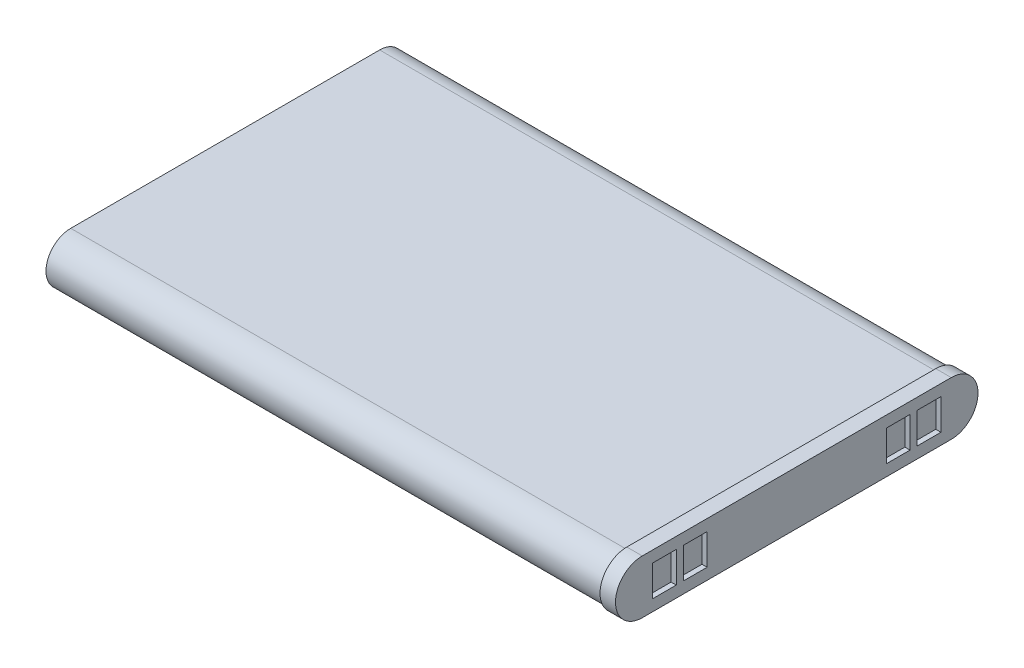
ISO-10303-21;
HEADER;
FILE_DESCRIPTION(('STEP AP214'),'2;1');
FILE_NAME('part.step','',(''),(''),'','','');
FILE_SCHEMA(('AUTOMOTIVE_DESIGN { 1 0 10303 214 1 1 1 1 }'));
ENDSEC;
DATA;
#1=APPLICATION_CONTEXT('core data for automotive mechanical design processes');
#2=APPLICATION_PROTOCOL_DEFINITION('international standard','automotive_design',2000,#1);
#3=PRODUCT_CONTEXT('',#1,'mechanical');
#4=PRODUCT('Part','Part','',(#3));
#5=PRODUCT_RELATED_PRODUCT_CATEGORY('part','',(#4));
#6=PRODUCT_DEFINITION_FORMATION('','',#4);
#7=PRODUCT_DEFINITION_CONTEXT('part definition',#1,'design');
#8=PRODUCT_DEFINITION('design','',#6,#7);
#9=PRODUCT_DEFINITION_SHAPE('','',#8);
#10=(LENGTH_UNIT() NAMED_UNIT(*) SI_UNIT(.MILLI.,.METRE.));
#11=(NAMED_UNIT(*) PLANE_ANGLE_UNIT() SI_UNIT($,.RADIAN.));
#12=(NAMED_UNIT(*) SI_UNIT($,.STERADIAN.) SOLID_ANGLE_UNIT());
#13=UNCERTAINTY_MEASURE_WITH_UNIT(LENGTH_MEASURE(1.E-05),#10,'distance_accuracy_value','');
#14=(GEOMETRIC_REPRESENTATION_CONTEXT(3) GLOBAL_UNCERTAINTY_ASSIGNED_CONTEXT((#13)) GLOBAL_UNIT_ASSIGNED_CONTEXT((#10,
#11,#12)) REPRESENTATION_CONTEXT('',''));
#15=CARTESIAN_POINT('',(0.,0.,0.));
#16=DIRECTION('',(0.,0.,1.));
#17=DIRECTION('',(1.,0.,0.));
#18=AXIS2_PLACEMENT_3D('',#15,#16,#17);
#19=CARTESIAN_POINT('',(54.,0.,15.));
#20=DIRECTION('',(-1.,0.,0.));
#21=DIRECTION('',(0.,0.,1.));
#22=AXIS2_PLACEMENT_3D('',#19,#20,#21);
#23=CYLINDRICAL_SURFACE('',#22,2.4);
#24=CARTESIAN_POINT('',(0.,0.,15.));
#25=DIRECTION('',(1.,0.,0.));
#26=DIRECTION('',(0.,0.,-1.));
#27=AXIS2_PLACEMENT_3D('',#24,#25,#26);
#28=CIRCLE('',#27,2.4);
#29=CARTESIAN_POINT('',(0.,2.4,15.));
#30=VERTEX_POINT('',#29);
#31=CARTESIAN_POINT('',(0.,-2.4,15.));
#32=VERTEX_POINT('',#31);
#33=EDGE_CURVE('E357',#30,#32,#28,.T.);
#34=ORIENTED_EDGE('',*,*,#33,.T.);
#35=DIRECTION('',(-1.,0.,0.));
#36=VECTOR('',#35,1.);
#37=CARTESIAN_POINT('',(54.,-2.4,15.));
#38=LINE('',#37,#36);
#39=CARTESIAN_POINT('',(54.,-2.4,15.));
#40=VERTEX_POINT('',#39);
#41=EDGE_CURVE('E11',#40,#32,#38,.T.);
#42=ORIENTED_EDGE('',*,*,#41,.F.);
#43=CARTESIAN_POINT('',(54.,0.,15.));
#44=DIRECTION('',(1.,0.,0.));
#45=DIRECTION('',(0.,0.,-1.));
#46=AXIS2_PLACEMENT_3D('',#43,#44,#45);
#47=CIRCLE('',#46,2.4);
#48=CARTESIAN_POINT('',(54.,2.4,15.));
#49=VERTEX_POINT('',#48);
#50=EDGE_CURVE('E358',#49,#40,#47,.T.);
#51=ORIENTED_EDGE('',*,*,#50,.F.);
#52=DIRECTION('',(-1.,0.,0.));
#53=VECTOR('',#52,1.);
#54=CARTESIAN_POINT('',(54.,2.4,15.));
#55=LINE('',#54,#53);
#56=EDGE_CURVE('E371',#49,#30,#55,.T.);
#57=ORIENTED_EDGE('',*,*,#56,.T.);
#58=EDGE_LOOP('',(#34,#42,#51,#57));
#59=FACE_BOUND('',#58,.T.);
#60=ADVANCED_FACE('F35',(#59),#23,.T.);
#61=CARTESIAN_POINT('',(54.,-2.4,15.));
#62=DIRECTION('',(0.,1.,0.));
#63=DIRECTION('',(0.,0.,1.));
#64=AXIS2_PLACEMENT_3D('',#61,#62,#63);
#65=PLANE('',#64);
#66=DIRECTION('',(0.,0.,-1.));
#67=VECTOR('',#66,1.);
#68=CARTESIAN_POINT('',(0.,-2.4,15.));
#69=LINE('',#68,#67);
#70=CARTESIAN_POINT('',(0.,-2.4,-15.));
#71=VERTEX_POINT('',#70);
#72=EDGE_CURVE('E374',#32,#71,#69,.T.);
#73=ORIENTED_EDGE('',*,*,#72,.T.);
#74=DIRECTION('',(-1.,0.,0.));
#75=VECTOR('',#74,1.);
#76=CARTESIAN_POINT('',(54.,-2.4,-15.));
#77=LINE('',#76,#75);
#78=CARTESIAN_POINT('',(54.,-2.4,-15.));
#79=VERTEX_POINT('',#78);
#80=EDGE_CURVE('E42',#79,#71,#77,.T.);
#81=ORIENTED_EDGE('',*,*,#80,.F.);
#82=DIRECTION('',(0.,0.,-1.));
#83=VECTOR('',#82,1.);
#84=CARTESIAN_POINT('',(54.,-2.4,15.));
#85=LINE('',#84,#83);
#86=EDGE_CURVE('E361',#40,#79,#85,.T.);
#87=ORIENTED_EDGE('',*,*,#86,.F.);
#88=ORIENTED_EDGE('',*,*,#41,.T.);
#89=EDGE_LOOP('',(#73,#81,#87,#88));
#90=FACE_BOUND('',#89,.T.);
#91=ADVANCED_FACE('F401',(#90),#65,.F.);
#92=CARTESIAN_POINT('',(54.,0.,-15.));
#93=DIRECTION('',(-1.,0.,0.));
#94=DIRECTION('',(0.,0.,1.));
#95=AXIS2_PLACEMENT_3D('',#92,#93,#94);
#96=CYLINDRICAL_SURFACE('',#95,2.4);
#97=CARTESIAN_POINT('',(0.,0.,-15.));
#98=DIRECTION('',(1.,0.,0.));
#99=DIRECTION('',(0.,0.,-1.));
#100=AXIS2_PLACEMENT_3D('',#97,#98,#99);
#101=CIRCLE('',#100,2.4);
#102=CARTESIAN_POINT('',(0.,2.40000000000001,-15.));
#103=VERTEX_POINT('',#102);
#104=EDGE_CURVE('E376',#71,#103,#101,.T.);
#105=ORIENTED_EDGE('',*,*,#104,.T.);
#106=DIRECTION('',(-1.,0.,0.));
#107=VECTOR('',#106,1.);
#108=CARTESIAN_POINT('',(54.,2.40000000000001,-15.));
#109=LINE('',#108,#107);
#110=CARTESIAN_POINT('',(54.,2.40000000000001,-15.));
#111=VERTEX_POINT('',#110);
#112=EDGE_CURVE('E381',#111,#103,#109,.T.);
#113=ORIENTED_EDGE('',*,*,#112,.F.);
#114=CARTESIAN_POINT('',(54.,0.,-15.));
#115=DIRECTION('',(1.,0.,0.));
#116=DIRECTION('',(0.,0.,-1.));
#117=AXIS2_PLACEMENT_3D('',#114,#115,#116);
#118=CIRCLE('',#117,2.4);
#119=EDGE_CURVE('E365',#79,#111,#118,.T.);
#120=ORIENTED_EDGE('',*,*,#119,.F.);
#121=ORIENTED_EDGE('',*,*,#80,.T.);
#122=EDGE_LOOP('',(#105,#113,#120,#121));
#123=FACE_BOUND('',#122,.T.);
#124=ADVANCED_FACE('F387',(#123),#96,.T.);
#125=CARTESIAN_POINT('',(54.,2.4,15.));
#126=DIRECTION('',(0.,-1.,0.));
#127=DIRECTION('',(0.,0.,-1.));
#128=AXIS2_PLACEMENT_3D('',#125,#126,#127);
#129=PLANE('',#128);
#130=DIRECTION('',(0.,0.,1.));
#131=VECTOR('',#130,1.);
#132=CARTESIAN_POINT('',(0.,2.4,15.));
#133=LINE('',#132,#131);
#134=EDGE_CURVE('E362',#103,#30,#133,.T.);
#135=ORIENTED_EDGE('',*,*,#134,.T.);
#136=ORIENTED_EDGE('',*,*,#56,.F.);
#137=DIRECTION('',(0.,0.,1.));
#138=VECTOR('',#137,1.);
#139=CARTESIAN_POINT('',(54.,2.4,15.));
#140=LINE('',#139,#138);
#141=EDGE_CURVE('E368',#111,#49,#140,.T.);
#142=ORIENTED_EDGE('',*,*,#141,.F.);
#143=ORIENTED_EDGE('',*,*,#112,.T.);
#144=EDGE_LOOP('',(#135,#136,#142,#143));
#145=FACE_BOUND('',#144,.T.);
#146=ADVANCED_FACE('F395',(#145),#129,.F.);
#147=CARTESIAN_POINT('',(0.,0.,15.));
#148=DIRECTION('',(1.,0.,0.));
#149=DIRECTION('',(0.,0.,-1.));
#150=AXIS2_PLACEMENT_3D('',#147,#148,#149);
#151=PLANE('',#150);
#152=ORIENTED_EDGE('',*,*,#33,.F.);
#153=ORIENTED_EDGE('',*,*,#134,.F.);
#154=ORIENTED_EDGE('',*,*,#104,.F.);
#155=ORIENTED_EDGE('',*,*,#72,.F.);
#156=EDGE_LOOP('',(#152,#153,#154,#155));
#157=FACE_BOUND('',#156,.T.);
#158=ADVANCED_FACE('F392',(#157),#151,.F.);
#159=CARTESIAN_POINT('',(54.,0.,15.));
#160=DIRECTION('',(1.,0.,0.));
#161=DIRECTION('',(0.,0.,-1.));
#162=AXIS2_PLACEMENT_3D('',#159,#160,#161);
#163=PLANE('',#162);
#164=CARTESIAN_POINT('',(54.,0.,15.));
#165=DIRECTION('',(1.,0.,0.));
#166=DIRECTION('',(0.,0.,-1.));
#167=AXIS2_PLACEMENT_3D('',#164,#165,#166);
#168=CIRCLE('',#167,2.6);
#169=CARTESIAN_POINT('',(54.,2.6,15.));
#170=VERTEX_POINT('',#169);
#171=CARTESIAN_POINT('',(54.,-2.6,15.));
#172=VERTEX_POINT('',#171);
#173=EDGE_CURVE('E321',#170,#172,#168,.T.);
#174=ORIENTED_EDGE('',*,*,#173,.F.);
#175=DIRECTION('',(0.,0.,1.));
#176=VECTOR('',#175,1.);
#177=CARTESIAN_POINT('',(54.,2.6,-15.));
#178=LINE('',#177,#176);
#179=CARTESIAN_POINT('',(54.,2.6,-15.));
#180=VERTEX_POINT('',#179);
#181=EDGE_CURVE('E332',#180,#170,#178,.T.);
#182=ORIENTED_EDGE('',*,*,#181,.F.);
#183=CARTESIAN_POINT('',(54.,0.,-15.));
#184=DIRECTION('',(1.,0.,0.));
#185=DIRECTION('',(0.,0.,-1.));
#186=AXIS2_PLACEMENT_3D('',#183,#184,#185);
#187=CIRCLE('',#186,2.6);
#188=CARTESIAN_POINT('',(54.,-2.6,-15.));
#189=VERTEX_POINT('',#188);
#190=EDGE_CURVE('E343',#189,#180,#187,.T.);
#191=ORIENTED_EDGE('',*,*,#190,.F.);
#192=DIRECTION('',(0.,0.,-1.));
#193=VECTOR('',#192,1.);
#194=CARTESIAN_POINT('',(54.,-2.6,15.));
#195=LINE('',#194,#193);
#196=EDGE_CURVE('E341',#172,#189,#195,.T.);
#197=ORIENTED_EDGE('',*,*,#196,.F.);
#198=EDGE_LOOP('',(#174,#182,#191,#197));
#199=FACE_BOUND('',#198,.T.);
#200=ORIENTED_EDGE('',*,*,#141,.T.);
#201=ORIENTED_EDGE('',*,*,#50,.T.);
#202=ORIENTED_EDGE('',*,*,#86,.T.);
#203=ORIENTED_EDGE('',*,*,#119,.T.);
#204=EDGE_LOOP('',(#200,#201,#202,#203));
#205=FACE_BOUND('',#204,.T.);
#206=ADVANCED_FACE('F400',(#199,#205),#163,.F.);
#207=CARTESIAN_POINT('',(55.5,0.,15.));
#208=DIRECTION('',(-1.,0.,0.));
#209=DIRECTION('',(0.,0.,1.));
#210=AXIS2_PLACEMENT_3D('',#207,#208,#209);
#211=CYLINDRICAL_SURFACE('',#210,2.6);
#212=ORIENTED_EDGE('',*,*,#173,.T.);
#213=DIRECTION('',(-1.,0.,0.));
#214=VECTOR('',#213,1.);
#215=CARTESIAN_POINT('',(55.5,-2.6,15.));
#216=LINE('',#215,#214);
#217=CARTESIAN_POINT('',(55.5,-2.6,15.));
#218=VERTEX_POINT('',#217);
#219=EDGE_CURVE('E354',#218,#172,#216,.T.);
#220=ORIENTED_EDGE('',*,*,#219,.F.);
#221=CARTESIAN_POINT('',(55.5,0.,15.));
#222=DIRECTION('',(1.,0.,0.));
#223=DIRECTION('',(0.,0.,-1.));
#224=AXIS2_PLACEMENT_3D('',#221,#222,#223);
#225=CIRCLE('',#224,2.6);
#226=CARTESIAN_POINT('',(55.5,2.6,15.));
#227=VERTEX_POINT('',#226);
#228=EDGE_CURVE('E328',#227,#218,#225,.T.);
#229=ORIENTED_EDGE('',*,*,#228,.F.);
#230=DIRECTION('',(-1.,0.,0.));
#231=VECTOR('',#230,1.);
#232=CARTESIAN_POINT('',(55.5,2.6,15.));
#233=LINE('',#232,#231);
#234=EDGE_CURVE('E338',#227,#170,#233,.T.);
#235=ORIENTED_EDGE('',*,*,#234,.T.);
#236=EDGE_LOOP('',(#212,#220,#229,#235));
#237=FACE_BOUND('',#236,.T.);
#238=ADVANCED_FACE('F413',(#237),#211,.T.);
#239=CARTESIAN_POINT('',(55.5,-2.6,15.));
#240=DIRECTION('',(0.,1.,0.));
#241=DIRECTION('',(0.,0.,1.));
#242=AXIS2_PLACEMENT_3D('',#239,#240,#241);
#243=PLANE('',#242);
#244=ORIENTED_EDGE('',*,*,#196,.T.);
#245=DIRECTION('',(-1.,0.,0.));
#246=VECTOR('',#245,1.);
#247=CARTESIAN_POINT('',(55.5,-2.6,-15.));
#248=LINE('',#247,#246);
#249=CARTESIAN_POINT('',(55.5,-2.6,-15.));
#250=VERTEX_POINT('',#249);
#251=EDGE_CURVE('E351',#250,#189,#248,.T.);
#252=ORIENTED_EDGE('',*,*,#251,.F.);
#253=DIRECTION('',(0.,0.,-1.));
#254=VECTOR('',#253,1.);
#255=CARTESIAN_POINT('',(55.5,-2.6,15.));
#256=LINE('',#255,#254);
#257=EDGE_CURVE('E331',#218,#250,#256,.T.);
#258=ORIENTED_EDGE('',*,*,#257,.F.);
#259=ORIENTED_EDGE('',*,*,#219,.T.);
#260=EDGE_LOOP('',(#244,#252,#258,#259));
#261=FACE_BOUND('',#260,.T.);
#262=ADVANCED_FACE('F416',(#261),#243,.F.);
#263=CARTESIAN_POINT('',(55.5,0.,-15.));
#264=DIRECTION('',(-1.,0.,0.));
#265=DIRECTION('',(0.,0.,1.));
#266=AXIS2_PLACEMENT_3D('',#263,#264,#265);
#267=CYLINDRICAL_SURFACE('',#266,2.6);
#268=ORIENTED_EDGE('',*,*,#190,.T.);
#269=DIRECTION('',(-1.,0.,0.));
#270=VECTOR('',#269,1.);
#271=CARTESIAN_POINT('',(55.5,2.6,-15.));
#272=LINE('',#271,#270);
#273=CARTESIAN_POINT('',(55.5,2.6,-15.));
#274=VERTEX_POINT('',#273);
#275=EDGE_CURVE('E348',#274,#180,#272,.T.);
#276=ORIENTED_EDGE('',*,*,#275,.F.);
#277=CARTESIAN_POINT('',(55.5,0.,-15.));
#278=DIRECTION('',(1.,0.,0.));
#279=DIRECTION('',(0.,0.,-1.));
#280=AXIS2_PLACEMENT_3D('',#277,#278,#279);
#281=CIRCLE('',#280,2.6);
#282=EDGE_CURVE('E334',#250,#274,#281,.T.);
#283=ORIENTED_EDGE('',*,*,#282,.F.);
#284=ORIENTED_EDGE('',*,*,#251,.T.);
#285=EDGE_LOOP('',(#268,#276,#283,#284));
#286=FACE_BOUND('',#285,.T.);
#287=ADVANCED_FACE('F420',(#286),#267,.T.);
#288=CARTESIAN_POINT('',(55.5,2.6,-15.));
#289=DIRECTION('',(0.,-1.,0.));
#290=DIRECTION('',(0.,0.,-1.));
#291=AXIS2_PLACEMENT_3D('',#288,#289,#290);
#292=PLANE('',#291);
#293=ORIENTED_EDGE('',*,*,#181,.T.);
#294=ORIENTED_EDGE('',*,*,#234,.F.);
#295=DIRECTION('',(0.,0.,1.));
#296=VECTOR('',#295,1.);
#297=CARTESIAN_POINT('',(55.5,2.6,-15.));
#298=LINE('',#297,#296);
#299=EDGE_CURVE('E336',#274,#227,#298,.T.);
#300=ORIENTED_EDGE('',*,*,#299,.F.);
#301=ORIENTED_EDGE('',*,*,#275,.T.);
#302=EDGE_LOOP('',(#293,#294,#300,#301));
#303=FACE_BOUND('',#302,.T.);
#304=ADVANCED_FACE('F424',(#303),#292,.F.);
#305=CARTESIAN_POINT('',(55.5,0.,15.));
#306=DIRECTION('',(1.,0.,0.));
#307=DIRECTION('',(0.,0.,-1.));
#308=AXIS2_PLACEMENT_3D('',#305,#306,#307);
#309=PLANE('',#308);
#310=DIRECTION('',(0.,-1.,0.));
#311=VECTOR('',#310,1.);
#312=CARTESIAN_POINT('',(55.5,1.5,11.));
#313=LINE('',#312,#311);
#314=CARTESIAN_POINT('',(55.5,1.5,11.));
#315=VERTEX_POINT('',#314);
#316=CARTESIAN_POINT('',(55.5,-1.5,11.));
#317=VERTEX_POINT('',#316);
#318=EDGE_CURVE('E49',#315,#317,#313,.T.);
#319=ORIENTED_EDGE('',*,*,#318,.F.);
#320=DIRECTION('',(0.,0.,1.));
#321=VECTOR('',#320,1.);
#322=CARTESIAN_POINT('',(55.5,1.5,11.));
#323=LINE('',#322,#321);
#324=CARTESIAN_POINT('',(55.5,1.5,8.7));
#325=VERTEX_POINT('',#324);
#326=EDGE_CURVE('E215',#325,#315,#323,.T.);
#327=ORIENTED_EDGE('',*,*,#326,.F.);
#328=DIRECTION('',(0.,1.,0.));
#329=VECTOR('',#328,1.);
#330=CARTESIAN_POINT('',(55.5,1.5,8.7));
#331=LINE('',#330,#329);
#332=CARTESIAN_POINT('',(55.5,-1.5,8.7));
#333=VERTEX_POINT('',#332);
#334=EDGE_CURVE('E218',#333,#325,#331,.T.);
#335=ORIENTED_EDGE('',*,*,#334,.F.);
#336=DIRECTION('',(0.,0.,-1.));
#337=VECTOR('',#336,1.);
#338=CARTESIAN_POINT('',(55.5,-1.5,11.));
#339=LINE('',#338,#337);
#340=EDGE_CURVE('E224',#317,#333,#339,.T.);
#341=ORIENTED_EDGE('',*,*,#340,.F.);
#342=EDGE_LOOP('',(#319,#327,#335,#341));
#343=FACE_BOUND('',#342,.T.);
#344=DIRECTION('',(0.,0.,1.));
#345=VECTOR('',#344,1.);
#346=CARTESIAN_POINT('',(55.5,1.5,-11.));
#347=LINE('',#346,#345);
#348=CARTESIAN_POINT('',(55.5,1.5,-11.));
#349=VERTEX_POINT('',#348);
#350=CARTESIAN_POINT('',(55.5,1.5,-8.7));
#351=VERTEX_POINT('',#350);
#352=EDGE_CURVE('E57',#349,#351,#347,.T.);
#353=ORIENTED_EDGE('',*,*,#352,.F.);
#354=DIRECTION('',(0.,1.,0.));
#355=VECTOR('',#354,1.);
#356=CARTESIAN_POINT('',(55.5,1.5,-11.));
#357=LINE('',#356,#355);
#358=CARTESIAN_POINT('',(55.5,-1.5,-11.));
#359=VERTEX_POINT('',#358);
#360=EDGE_CURVE('E239',#359,#349,#357,.T.);
#361=ORIENTED_EDGE('',*,*,#360,.F.);
#362=DIRECTION('',(0.,0.,-1.));
#363=VECTOR('',#362,1.);
#364=CARTESIAN_POINT('',(55.5,-1.5,-11.));
#365=LINE('',#364,#363);
#366=CARTESIAN_POINT('',(55.5,-1.5,-8.7));
#367=VERTEX_POINT('',#366);
#368=EDGE_CURVE('E254',#367,#359,#365,.T.);
#369=ORIENTED_EDGE('',*,*,#368,.F.);
#370=DIRECTION('',(0.,-1.,0.));
#371=VECTOR('',#370,1.);
#372=CARTESIAN_POINT('',(55.5,1.5,-8.7));
#373=LINE('',#372,#371);
#374=EDGE_CURVE('E250',#351,#367,#373,.T.);
#375=ORIENTED_EDGE('',*,*,#374,.F.);
#376=EDGE_LOOP('',(#353,#361,#369,#375));
#377=FACE_BOUND('',#376,.T.);
#378=DIRECTION('',(0.,0.,1.));
#379=VECTOR('',#378,1.);
#380=CARTESIAN_POINT('',(55.5,1.5,-14.));
#381=LINE('',#380,#379);
#382=CARTESIAN_POINT('',(55.5,1.5,-14.));
#383=VERTEX_POINT('',#382);
#384=CARTESIAN_POINT('',(55.5,1.5,-11.7));
#385=VERTEX_POINT('',#384);
#386=EDGE_CURVE('E279',#383,#385,#381,.T.);
#387=ORIENTED_EDGE('',*,*,#386,.F.);
#388=DIRECTION('',(0.,1.,0.));
#389=VECTOR('',#388,1.);
#390=CARTESIAN_POINT('',(55.5,1.5,-14.));
#391=LINE('',#390,#389);
#392=CARTESIAN_POINT('',(55.5,-1.5,-14.));
#393=VERTEX_POINT('',#392);
#394=EDGE_CURVE('E269',#393,#383,#391,.T.);
#395=ORIENTED_EDGE('',*,*,#394,.F.);
#396=DIRECTION('',(0.,0.,-1.));
#397=VECTOR('',#396,1.);
#398=CARTESIAN_POINT('',(55.5,-1.5,-14.));
#399=LINE('',#398,#397);
#400=CARTESIAN_POINT('',(55.5,-1.5,-11.7));
#401=VERTEX_POINT('',#400);
#402=EDGE_CURVE('E284',#401,#393,#399,.T.);
#403=ORIENTED_EDGE('',*,*,#402,.F.);
#404=DIRECTION('',(0.,-1.,0.));
#405=VECTOR('',#404,1.);
#406=CARTESIAN_POINT('',(55.5,1.5,-11.7));
#407=LINE('',#406,#405);
#408=EDGE_CURVE('E281',#385,#401,#407,.T.);
#409=ORIENTED_EDGE('',*,*,#408,.F.);
#410=EDGE_LOOP('',(#387,#395,#403,#409));
#411=FACE_BOUND('',#410,.T.);
#412=DIRECTION('',(0.,-1.,0.));
#413=VECTOR('',#412,1.);
#414=CARTESIAN_POINT('',(55.5,1.5,14.));
#415=LINE('',#414,#413);
#416=CARTESIAN_POINT('',(55.5,1.5,14.));
#417=VERTEX_POINT('',#416);
#418=CARTESIAN_POINT('',(55.5,-1.5,14.));
#419=VERTEX_POINT('',#418);
#420=EDGE_CURVE('E231',#417,#419,#415,.T.);
#421=ORIENTED_EDGE('',*,*,#420,.F.);
#422=DIRECTION('',(0.,0.,1.));
#423=VECTOR('',#422,1.);
#424=CARTESIAN_POINT('',(55.5,1.5,14.));
#425=LINE('',#424,#423);
#426=CARTESIAN_POINT('',(55.5,1.5,11.7));
#427=VERTEX_POINT('',#426);
#428=EDGE_CURVE('E300',#427,#417,#425,.T.);
#429=ORIENTED_EDGE('',*,*,#428,.F.);
#430=DIRECTION('',(0.,1.,0.));
#431=VECTOR('',#430,1.);
#432=CARTESIAN_POINT('',(55.5,1.5,11.7));
#433=LINE('',#432,#431);
#434=CARTESIAN_POINT('',(55.5,-1.5,11.7));
#435=VERTEX_POINT('',#434);
#436=EDGE_CURVE('E314',#435,#427,#433,.T.);
#437=ORIENTED_EDGE('',*,*,#436,.F.);
#438=DIRECTION('',(0.,0.,-1.));
#439=VECTOR('',#438,1.);
#440=CARTESIAN_POINT('',(55.5,-1.5,14.));
#441=LINE('',#440,#439);
#442=EDGE_CURVE('E311',#419,#435,#441,.T.);
#443=ORIENTED_EDGE('',*,*,#442,.F.);
#444=EDGE_LOOP('',(#421,#429,#437,#443));
#445=FACE_BOUND('',#444,.T.);
#446=ORIENTED_EDGE('',*,*,#228,.T.);
#447=ORIENTED_EDGE('',*,*,#257,.T.);
#448=ORIENTED_EDGE('',*,*,#282,.T.);
#449=ORIENTED_EDGE('',*,*,#299,.T.);
#450=EDGE_LOOP('',(#446,#447,#448,#449));
#451=FACE_BOUND('',#450,.T.);
#452=ADVANCED_FACE('F428',(#343,#377,#411,#445,#451),#309,.T.);
#453=CARTESIAN_POINT('',(55.,1.5,14.));
#454=DIRECTION('',(0.,0.,1.));
#455=DIRECTION('',(1.,0.,0.));
#456=AXIS2_PLACEMENT_3D('',#453,#454,#455);
#457=PLANE('',#456);
#458=ORIENTED_EDGE('',*,*,#420,.T.);
#459=DIRECTION('',(1.,0.,0.));
#460=VECTOR('',#459,1.);
#461=CARTESIAN_POINT('',(55.,-1.5,14.));
#462=LINE('',#461,#460);
#463=CARTESIAN_POINT('',(55.,-1.5,14.));
#464=VERTEX_POINT('',#463);
#465=EDGE_CURVE('E309',#464,#419,#462,.T.);
#466=ORIENTED_EDGE('',*,*,#465,.F.);
#467=DIRECTION('',(0.,-1.,0.));
#468=VECTOR('',#467,1.);
#469=CARTESIAN_POINT('',(55.,1.5,14.));
#470=LINE('',#469,#468);
#471=CARTESIAN_POINT('',(55.,1.5,14.));
#472=VERTEX_POINT('',#471);
#473=EDGE_CURVE('E296',#472,#464,#470,.T.);
#474=ORIENTED_EDGE('',*,*,#473,.F.);
#475=DIRECTION('',(1.,0.,0.));
#476=VECTOR('',#475,1.);
#477=CARTESIAN_POINT('',(55.,1.5,14.));
#478=LINE('',#477,#476);
#479=EDGE_CURVE('E319',#472,#417,#478,.T.);
#480=ORIENTED_EDGE('',*,*,#479,.T.);
#481=EDGE_LOOP('',(#458,#466,#474,#480));
#482=FACE_BOUND('',#481,.T.);
#483=ADVANCED_FACE('F435',(#482),#457,.F.);
#484=CARTESIAN_POINT('',(55.,1.5,14.));
#485=DIRECTION('',(0.,1.,0.));
#486=DIRECTION('',(0.,0.,1.));
#487=AXIS2_PLACEMENT_3D('',#484,#485,#486);
#488=PLANE('',#487);
#489=ORIENTED_EDGE('',*,*,#428,.T.);
#490=ORIENTED_EDGE('',*,*,#479,.F.);
#491=DIRECTION('',(0.,0.,1.));
#492=VECTOR('',#491,1.);
#493=CARTESIAN_POINT('',(55.,1.5,14.));
#494=LINE('',#493,#492);
#495=CARTESIAN_POINT('',(55.,1.5,11.7));
#496=VERTEX_POINT('',#495);
#497=EDGE_CURVE('E306',#496,#472,#494,.T.);
#498=ORIENTED_EDGE('',*,*,#497,.F.);
#499=DIRECTION('',(1.,0.,0.));
#500=VECTOR('',#499,1.);
#501=CARTESIAN_POINT('',(55.,1.5,11.7));
#502=LINE('',#501,#500);
#503=EDGE_CURVE('E322',#496,#427,#502,.T.);
#504=ORIENTED_EDGE('',*,*,#503,.T.);
#505=EDGE_LOOP('',(#489,#490,#498,#504));
#506=FACE_BOUND('',#505,.T.);
#507=ADVANCED_FACE('F439',(#506),#488,.F.);
#508=CARTESIAN_POINT('',(55.,1.5,11.7));
#509=DIRECTION('',(0.,0.,-1.));
#510=DIRECTION('',(-1.,0.,0.));
#511=AXIS2_PLACEMENT_3D('',#508,#509,#510);
#512=PLANE('',#511);
#513=ORIENTED_EDGE('',*,*,#436,.T.);
#514=ORIENTED_EDGE('',*,*,#503,.F.);
#515=DIRECTION('',(0.,1.,0.));
#516=VECTOR('',#515,1.);
#517=CARTESIAN_POINT('',(55.,1.5,11.7));
#518=LINE('',#517,#516);
#519=CARTESIAN_POINT('',(55.,-1.5,11.7));
#520=VERTEX_POINT('',#519);
#521=EDGE_CURVE('E303',#520,#496,#518,.T.);
#522=ORIENTED_EDGE('',*,*,#521,.F.);
#523=DIRECTION('',(1.,0.,0.));
#524=VECTOR('',#523,1.);
#525=CARTESIAN_POINT('',(55.,-1.5,11.7));
#526=LINE('',#525,#524);
#527=EDGE_CURVE('E324',#520,#435,#526,.T.);
#528=ORIENTED_EDGE('',*,*,#527,.T.);
#529=EDGE_LOOP('',(#513,#514,#522,#528));
#530=FACE_BOUND('',#529,.T.);
#531=ADVANCED_FACE('F445',(#530),#512,.F.);
#532=CARTESIAN_POINT('',(55.,-1.5,14.));
#533=DIRECTION('',(0.,-1.,0.));
#534=DIRECTION('',(0.,0.,-1.));
#535=AXIS2_PLACEMENT_3D('',#532,#533,#534);
#536=PLANE('',#535);
#537=ORIENTED_EDGE('',*,*,#442,.T.);
#538=ORIENTED_EDGE('',*,*,#527,.F.);
#539=DIRECTION('',(0.,0.,-1.));
#540=VECTOR('',#539,1.);
#541=CARTESIAN_POINT('',(55.,-1.5,14.));
#542=LINE('',#541,#540);
#543=EDGE_CURVE('E299',#464,#520,#542,.T.);
#544=ORIENTED_EDGE('',*,*,#543,.F.);
#545=ORIENTED_EDGE('',*,*,#465,.T.);
#546=EDGE_LOOP('',(#537,#538,#544,#545));
#547=FACE_BOUND('',#546,.T.);
#548=ADVANCED_FACE('F441',(#547),#536,.F.);
#549=CARTESIAN_POINT('',(55.,0.,0.));
#550=DIRECTION('',(1.,0.,0.));
#551=DIRECTION('',(0.,0.,-1.));
#552=AXIS2_PLACEMENT_3D('',#549,#550,#551);
#553=PLANE('',#552);
#554=ORIENTED_EDGE('',*,*,#473,.T.);
#555=ORIENTED_EDGE('',*,*,#543,.T.);
#556=ORIENTED_EDGE('',*,*,#521,.T.);
#557=ORIENTED_EDGE('',*,*,#497,.T.);
#558=EDGE_LOOP('',(#554,#555,#556,#557));
#559=FACE_BOUND('',#558,.T.);
#560=ADVANCED_FACE('F444',(#559),#553,.T.);
#561=CARTESIAN_POINT('',(55.,1.5,-14.));
#562=DIRECTION('',(0.,1.,0.));
#563=DIRECTION('',(0.,0.,1.));
#564=AXIS2_PLACEMENT_3D('',#561,#562,#563);
#565=PLANE('',#564);
#566=ORIENTED_EDGE('',*,*,#386,.T.);
#567=DIRECTION('',(1.,0.,0.));
#568=VECTOR('',#567,1.);
#569=CARTESIAN_POINT('',(55.,1.5,-11.7));
#570=LINE('',#569,#568);
#571=CARTESIAN_POINT('',(55.,1.5,-11.7));
#572=VERTEX_POINT('',#571);
#573=EDGE_CURVE('E278',#572,#385,#570,.T.);
#574=ORIENTED_EDGE('',*,*,#573,.F.);
#575=DIRECTION('',(0.,0.,1.));
#576=VECTOR('',#575,1.);
#577=CARTESIAN_POINT('',(55.,1.5,-14.));
#578=LINE('',#577,#576);
#579=CARTESIAN_POINT('',(55.,1.5,-14.));
#580=VERTEX_POINT('',#579);
#581=EDGE_CURVE('E265',#580,#572,#578,.T.);
#582=ORIENTED_EDGE('',*,*,#581,.F.);
#583=DIRECTION('',(1.,0.,0.));
#584=VECTOR('',#583,1.);
#585=CARTESIAN_POINT('',(55.,1.5,-14.));
#586=LINE('',#585,#584);
#587=EDGE_CURVE('E251',#580,#383,#586,.T.);
#588=ORIENTED_EDGE('',*,*,#587,.T.);
#589=EDGE_LOOP('',(#566,#574,#582,#588));
#590=FACE_BOUND('',#589,.T.);
#591=ADVANCED_FACE('F455',(#590),#565,.F.);
#592=CARTESIAN_POINT('',(55.,1.5,-14.));
#593=DIRECTION('',(0.,0.,-1.));
#594=DIRECTION('',(-1.,0.,0.));
#595=AXIS2_PLACEMENT_3D('',#592,#593,#594);
#596=PLANE('',#595);
#597=ORIENTED_EDGE('',*,*,#394,.T.);
#598=ORIENTED_EDGE('',*,*,#587,.F.);
#599=DIRECTION('',(0.,1.,0.));
#600=VECTOR('',#599,1.);
#601=CARTESIAN_POINT('',(55.,1.5,-14.));
#602=LINE('',#601,#600);
#603=CARTESIAN_POINT('',(55.,-1.5,-14.));
#604=VERTEX_POINT('',#603);
#605=EDGE_CURVE('E275',#604,#580,#602,.T.);
#606=ORIENTED_EDGE('',*,*,#605,.F.);
#607=DIRECTION('',(1.,0.,0.));
#608=VECTOR('',#607,1.);
#609=CARTESIAN_POINT('',(55.,-1.5,-14.));
#610=LINE('',#609,#608);
#611=EDGE_CURVE('E290',#604,#393,#610,.T.);
#612=ORIENTED_EDGE('',*,*,#611,.T.);
#613=EDGE_LOOP('',(#597,#598,#606,#612));
#614=FACE_BOUND('',#613,.T.);
#615=ADVANCED_FACE('F459',(#614),#596,.F.);
#616=CARTESIAN_POINT('',(55.,-1.5,-14.));
#617=DIRECTION('',(0.,-1.,0.));
#618=DIRECTION('',(0.,0.,-1.));
#619=AXIS2_PLACEMENT_3D('',#616,#617,#618);
#620=PLANE('',#619);
#621=ORIENTED_EDGE('',*,*,#402,.T.);
#622=ORIENTED_EDGE('',*,*,#611,.F.);
#623=DIRECTION('',(0.,0.,-1.));
#624=VECTOR('',#623,1.);
#625=CARTESIAN_POINT('',(55.,-1.5,-14.));
#626=LINE('',#625,#624);
#627=CARTESIAN_POINT('',(55.,-1.5,-11.7));
#628=VERTEX_POINT('',#627);
#629=EDGE_CURVE('E272',#628,#604,#626,.T.);
#630=ORIENTED_EDGE('',*,*,#629,.F.);
#631=DIRECTION('',(1.,0.,0.));
#632=VECTOR('',#631,1.);
#633=CARTESIAN_POINT('',(55.,-1.5,-11.7));
#634=LINE('',#633,#632);
#635=EDGE_CURVE('E292',#628,#401,#634,.T.);
#636=ORIENTED_EDGE('',*,*,#635,.T.);
#637=EDGE_LOOP('',(#621,#622,#630,#636));
#638=FACE_BOUND('',#637,.T.);
#639=ADVANCED_FACE('F465',(#638),#620,.F.);
#640=CARTESIAN_POINT('',(55.,1.5,-11.7));
#641=DIRECTION('',(0.,0.,1.));
#642=DIRECTION('',(1.,0.,0.));
#643=AXIS2_PLACEMENT_3D('',#640,#641,#642);
#644=PLANE('',#643);
#645=ORIENTED_EDGE('',*,*,#408,.T.);
#646=ORIENTED_EDGE('',*,*,#635,.F.);
#647=DIRECTION('',(0.,-1.,0.));
#648=VECTOR('',#647,1.);
#649=CARTESIAN_POINT('',(55.,1.5,-11.7));
#650=LINE('',#649,#648);
#651=EDGE_CURVE('E268',#572,#628,#650,.T.);
#652=ORIENTED_EDGE('',*,*,#651,.F.);
#653=ORIENTED_EDGE('',*,*,#573,.T.);
#654=EDGE_LOOP('',(#645,#646,#652,#653));
#655=FACE_BOUND('',#654,.T.);
#656=ADVANCED_FACE('F461',(#655),#644,.F.);
#657=CARTESIAN_POINT('',(55.,0.,0.));
#658=DIRECTION('',(1.,0.,0.));
#659=DIRECTION('',(0.,0.,-1.));
#660=AXIS2_PLACEMENT_3D('',#657,#658,#659);
#661=PLANE('',#660);
#662=ORIENTED_EDGE('',*,*,#581,.T.);
#663=ORIENTED_EDGE('',*,*,#651,.T.);
#664=ORIENTED_EDGE('',*,*,#629,.T.);
#665=ORIENTED_EDGE('',*,*,#605,.T.);
#666=EDGE_LOOP('',(#662,#663,#664,#665));
#667=FACE_BOUND('',#666,.T.);
#668=ADVANCED_FACE('F464',(#667),#661,.T.);
#669=CARTESIAN_POINT('',(55.,1.5,-11.));
#670=DIRECTION('',(0.,1.,0.));
#671=DIRECTION('',(0.,0.,1.));
#672=AXIS2_PLACEMENT_3D('',#669,#670,#671);
#673=PLANE('',#672);
#674=ORIENTED_EDGE('',*,*,#352,.T.);
#675=DIRECTION('',(1.,0.,0.));
#676=VECTOR('',#675,1.);
#677=CARTESIAN_POINT('',(55.,1.5,-8.7));
#678=LINE('',#677,#676);
#679=CARTESIAN_POINT('',(55.,1.5,-8.7));
#680=VERTEX_POINT('',#679);
#681=EDGE_CURVE('E248',#680,#351,#678,.T.);
#682=ORIENTED_EDGE('',*,*,#681,.F.);
#683=DIRECTION('',(0.,0.,1.));
#684=VECTOR('',#683,1.);
#685=CARTESIAN_POINT('',(55.,1.5,-11.));
#686=LINE('',#685,#684);
#687=CARTESIAN_POINT('',(55.,1.5,-11.));
#688=VERTEX_POINT('',#687);
#689=EDGE_CURVE('E235',#688,#680,#686,.T.);
#690=ORIENTED_EDGE('',*,*,#689,.F.);
#691=DIRECTION('',(1.,0.,0.));
#692=VECTOR('',#691,1.);
#693=CARTESIAN_POINT('',(55.,1.5,-11.));
#694=LINE('',#693,#692);
#695=EDGE_CURVE('E225',#688,#349,#694,.T.);
#696=ORIENTED_EDGE('',*,*,#695,.T.);
#697=EDGE_LOOP('',(#674,#682,#690,#696));
#698=FACE_BOUND('',#697,.T.);
#699=ADVANCED_FACE('F475',(#698),#673,.F.);
#700=CARTESIAN_POINT('',(55.,1.5,-11.));
#701=DIRECTION('',(0.,0.,-1.));
#702=DIRECTION('',(-1.,0.,0.));
#703=AXIS2_PLACEMENT_3D('',#700,#701,#702);
#704=PLANE('',#703);
#705=ORIENTED_EDGE('',*,*,#360,.T.);
#706=ORIENTED_EDGE('',*,*,#695,.F.);
#707=DIRECTION('',(0.,1.,0.));
#708=VECTOR('',#707,1.);
#709=CARTESIAN_POINT('',(55.,1.5,-11.));
#710=LINE('',#709,#708);
#711=CARTESIAN_POINT('',(55.,-1.5,-11.));
#712=VERTEX_POINT('',#711);
#713=EDGE_CURVE('E245',#712,#688,#710,.T.);
#714=ORIENTED_EDGE('',*,*,#713,.F.);
#715=DIRECTION('',(1.,0.,0.));
#716=VECTOR('',#715,1.);
#717=CARTESIAN_POINT('',(55.,-1.5,-11.));
#718=LINE('',#717,#716);
#719=EDGE_CURVE('E260',#712,#359,#718,.T.);
#720=ORIENTED_EDGE('',*,*,#719,.T.);
#721=EDGE_LOOP('',(#705,#706,#714,#720));
#722=FACE_BOUND('',#721,.T.);
#723=ADVANCED_FACE('F479',(#722),#704,.F.);
#724=CARTESIAN_POINT('',(55.,-1.5,-11.));
#725=DIRECTION('',(0.,-1.,0.));
#726=DIRECTION('',(0.,0.,-1.));
#727=AXIS2_PLACEMENT_3D('',#724,#725,#726);
#728=PLANE('',#727);
#729=ORIENTED_EDGE('',*,*,#368,.T.);
#730=ORIENTED_EDGE('',*,*,#719,.F.);
#731=DIRECTION('',(0.,0.,-1.));
#732=VECTOR('',#731,1.);
#733=CARTESIAN_POINT('',(55.,-1.5,-11.));
#734=LINE('',#733,#732);
#735=CARTESIAN_POINT('',(55.,-1.5,-8.7));
#736=VERTEX_POINT('',#735);
#737=EDGE_CURVE('E242',#736,#712,#734,.T.);
#738=ORIENTED_EDGE('',*,*,#737,.F.);
#739=DIRECTION('',(1.,0.,0.));
#740=VECTOR('',#739,1.);
#741=CARTESIAN_POINT('',(55.,-1.5,-8.7));
#742=LINE('',#741,#740);
#743=EDGE_CURVE('E262',#736,#367,#742,.T.);
#744=ORIENTED_EDGE('',*,*,#743,.T.);
#745=EDGE_LOOP('',(#729,#730,#738,#744));
#746=FACE_BOUND('',#745,.T.);
#747=ADVANCED_FACE('F484',(#746),#728,.F.);
#748=CARTESIAN_POINT('',(55.,1.5,-8.7));
#749=DIRECTION('',(0.,0.,1.));
#750=DIRECTION('',(1.,0.,0.));
#751=AXIS2_PLACEMENT_3D('',#748,#749,#750);
#752=PLANE('',#751);
#753=ORIENTED_EDGE('',*,*,#374,.T.);
#754=ORIENTED_EDGE('',*,*,#743,.F.);
#755=DIRECTION('',(0.,-1.,0.));
#756=VECTOR('',#755,1.);
#757=CARTESIAN_POINT('',(55.,1.5,-8.7));
#758=LINE('',#757,#756);
#759=EDGE_CURVE('E238',#680,#736,#758,.T.);
#760=ORIENTED_EDGE('',*,*,#759,.F.);
#761=ORIENTED_EDGE('',*,*,#681,.T.);
#762=EDGE_LOOP('',(#753,#754,#760,#761));
#763=FACE_BOUND('',#762,.T.);
#764=ADVANCED_FACE('F480',(#763),#752,.F.);
#765=CARTESIAN_POINT('',(55.,0.,0.));
#766=DIRECTION('',(1.,0.,0.));
#767=DIRECTION('',(0.,0.,-1.));
#768=AXIS2_PLACEMENT_3D('',#765,#766,#767);
#769=PLANE('',#768);
#770=ORIENTED_EDGE('',*,*,#689,.T.);
#771=ORIENTED_EDGE('',*,*,#759,.T.);
#772=ORIENTED_EDGE('',*,*,#737,.T.);
#773=ORIENTED_EDGE('',*,*,#713,.T.);
#774=EDGE_LOOP('',(#770,#771,#772,#773));
#775=FACE_BOUND('',#774,.T.);
#776=ADVANCED_FACE('F483',(#775),#769,.T.);
#777=CARTESIAN_POINT('',(55.,1.5,11.));
#778=DIRECTION('',(0.,0.,1.));
#779=DIRECTION('',(1.,0.,0.));
#780=AXIS2_PLACEMENT_3D('',#777,#778,#779);
#781=PLANE('',#780);
#782=ORIENTED_EDGE('',*,*,#318,.T.);
#783=DIRECTION('',(1.,0.,0.));
#784=VECTOR('',#783,1.);
#785=CARTESIAN_POINT('',(55.,-1.5,11.));
#786=LINE('',#785,#784);
#787=CARTESIAN_POINT('',(55.,-1.5,11.));
#788=VERTEX_POINT('',#787);
#789=EDGE_CURVE('E193',#788,#317,#786,.T.);
#790=ORIENTED_EDGE('',*,*,#789,.F.);
#791=DIRECTION('',(0.,-1.,0.));
#792=VECTOR('',#791,1.);
#793=CARTESIAN_POINT('',(55.,1.5,11.));
#794=LINE('',#793,#792);
#795=CARTESIAN_POINT('',(55.,1.5,11.));
#796=VERTEX_POINT('',#795);
#797=EDGE_CURVE('E197',#796,#788,#794,.T.);
#798=ORIENTED_EDGE('',*,*,#797,.F.);
#799=DIRECTION('',(1.,0.,0.));
#800=VECTOR('',#799,1.);
#801=CARTESIAN_POINT('',(55.,1.5,11.));
#802=LINE('',#801,#800);
#803=EDGE_CURVE('E229',#796,#315,#802,.T.);
#804=ORIENTED_EDGE('',*,*,#803,.T.);
#805=EDGE_LOOP('',(#782,#790,#798,#804));
#806=FACE_BOUND('',#805,.T.);
#807=ADVANCED_FACE('F195',(#806),#781,.F.);
#808=CARTESIAN_POINT('',(55.,1.5,11.));
#809=DIRECTION('',(0.,1.,0.));
#810=DIRECTION('',(0.,0.,1.));
#811=AXIS2_PLACEMENT_3D('',#808,#809,#810);
#812=PLANE('',#811);
#813=ORIENTED_EDGE('',*,*,#326,.T.);
#814=ORIENTED_EDGE('',*,*,#803,.F.);
#815=DIRECTION('',(0.,0.,1.));
#816=VECTOR('',#815,1.);
#817=CARTESIAN_POINT('',(55.,1.5,11.));
#818=LINE('',#817,#816);
#819=CARTESIAN_POINT('',(55.,1.5,8.7));
#820=VERTEX_POINT('',#819);
#821=EDGE_CURVE('E203',#820,#796,#818,.T.);
#822=ORIENTED_EDGE('',*,*,#821,.F.);
#823=DIRECTION('',(1.,0.,0.));
#824=VECTOR('',#823,1.);
#825=CARTESIAN_POINT('',(55.,1.5,8.7));
#826=LINE('',#825,#824);
#827=EDGE_CURVE('E232',#820,#325,#826,.T.);
#828=ORIENTED_EDGE('',*,*,#827,.T.);
#829=EDGE_LOOP('',(#813,#814,#822,#828));
#830=FACE_BOUND('',#829,.T.);
#831=ADVANCED_FACE('F497',(#830),#812,.F.);
#832=CARTESIAN_POINT('',(55.,1.5,8.7));
#833=DIRECTION('',(0.,0.,-1.));
#834=DIRECTION('',(-1.,0.,0.));
#835=AXIS2_PLACEMENT_3D('',#832,#833,#834);
#836=PLANE('',#835);
#837=ORIENTED_EDGE('',*,*,#334,.T.);
#838=ORIENTED_EDGE('',*,*,#827,.F.);
#839=DIRECTION('',(0.,1.,0.));
#840=VECTOR('',#839,1.);
#841=CARTESIAN_POINT('',(55.,1.5,8.7));
#842=LINE('',#841,#840);
#843=CARTESIAN_POINT('',(55.,-1.5,8.7));
#844=VERTEX_POINT('',#843);
#845=EDGE_CURVE('E211',#844,#820,#842,.T.);
#846=ORIENTED_EDGE('',*,*,#845,.F.);
#847=DIRECTION('',(1.,0.,0.));
#848=VECTOR('',#847,1.);
#849=CARTESIAN_POINT('',(55.,-1.5,8.7));
#850=LINE('',#849,#848);
#851=EDGE_CURVE('E202',#844,#333,#850,.T.);
#852=ORIENTED_EDGE('',*,*,#851,.T.);
#853=EDGE_LOOP('',(#837,#838,#846,#852));
#854=FACE_BOUND('',#853,.T.);
#855=ADVANCED_FACE('F500',(#854),#836,.F.);
#856=CARTESIAN_POINT('',(55.,-1.5,11.));
#857=DIRECTION('',(0.,-1.,0.));
#858=DIRECTION('',(0.,0.,-1.));
#859=AXIS2_PLACEMENT_3D('',#856,#857,#858);
#860=PLANE('',#859);
#861=ORIENTED_EDGE('',*,*,#340,.T.);
#862=ORIENTED_EDGE('',*,*,#851,.F.);
#863=DIRECTION('',(0.,0.,-1.));
#864=VECTOR('',#863,1.);
#865=CARTESIAN_POINT('',(55.,-1.5,11.));
#866=LINE('',#865,#864);
#867=EDGE_CURVE('E206',#788,#844,#866,.T.);
#868=ORIENTED_EDGE('',*,*,#867,.F.);
#869=ORIENTED_EDGE('',*,*,#789,.T.);
#870=EDGE_LOOP('',(#861,#862,#868,#869));
#871=FACE_BOUND('',#870,.T.);
#872=ADVANCED_FACE('F207',(#871),#860,.F.);
#873=CARTESIAN_POINT('',(55.,0.,0.));
#874=DIRECTION('',(1.,0.,0.));
#875=DIRECTION('',(0.,0.,-1.));
#876=AXIS2_PLACEMENT_3D('',#873,#874,#875);
#877=PLANE('',#876);
#878=ORIENTED_EDGE('',*,*,#797,.T.);
#879=ORIENTED_EDGE('',*,*,#867,.T.);
#880=ORIENTED_EDGE('',*,*,#845,.T.);
#881=ORIENTED_EDGE('',*,*,#821,.T.);
#882=EDGE_LOOP('',(#878,#879,#880,#881));
#883=FACE_BOUND('',#882,.T.);
#884=ADVANCED_FACE('F213',(#883),#877,.T.);
#885=CLOSED_SHELL('',(#60,#91,#124,#146,#158,#206,#238,#262,#287,#304,#452,#483,#507,#531,#548,
#560,#591,#615,#639,#656,#668,#699,#723,#747,#764,#776,#807,#831,#855,#872,#884));
#886=MANIFOLD_SOLID_BREP('B2',#885);
#887=ADVANCED_BREP_SHAPE_REPRESENTATION('',(#18,#886),#14);
#888=SHAPE_DEFINITION_REPRESENTATION(#9,#887);
ENDSEC;
END-ISO-10303-21;
